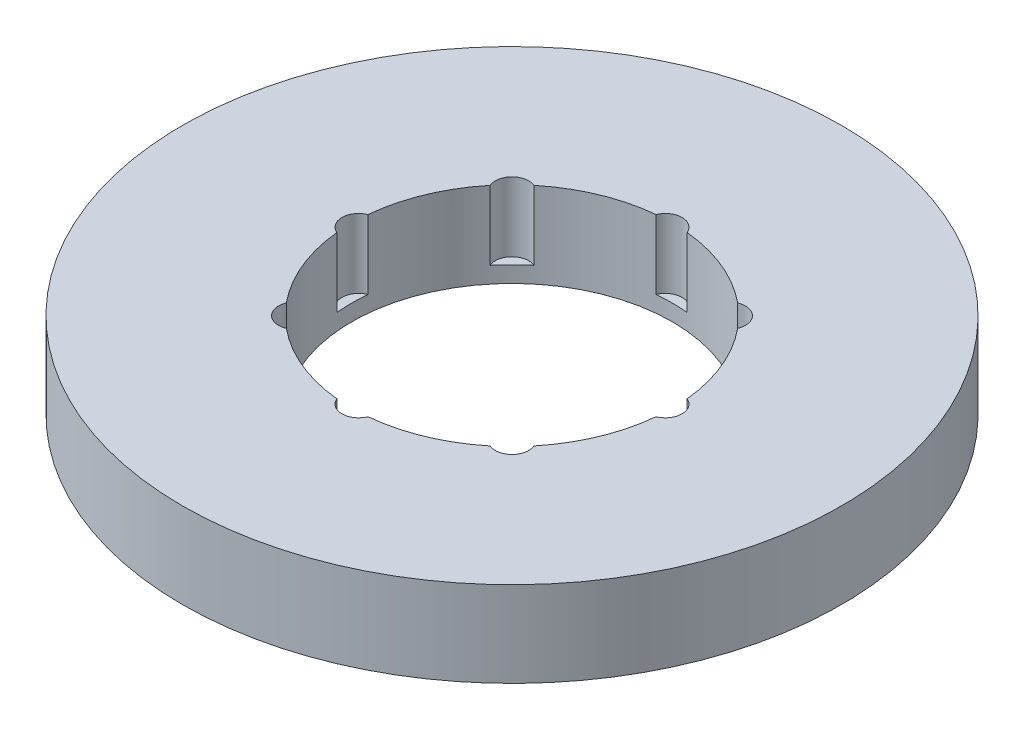
ISO-10303-21;
HEADER;
FILE_DESCRIPTION(('STEP AP214'),'2;1');
FILE_NAME('part.step','',(''),(''),'','','');
FILE_SCHEMA(('AUTOMOTIVE_DESIGN { 1 0 10303 214 1 1 1 1 }'));
ENDSEC;
DATA;
#1=APPLICATION_CONTEXT('core data for automotive mechanical design processes');
#2=APPLICATION_PROTOCOL_DEFINITION('international standard','automotive_design',2000,#1);
#3=PRODUCT_CONTEXT('',#1,'mechanical');
#4=PRODUCT('Part','Part','',(#3));
#5=PRODUCT_RELATED_PRODUCT_CATEGORY('part','',(#4));
#6=PRODUCT_DEFINITION_FORMATION('','',#4);
#7=PRODUCT_DEFINITION_CONTEXT('part definition',#1,'design');
#8=PRODUCT_DEFINITION('design','',#6,#7);
#9=PRODUCT_DEFINITION_SHAPE('','',#8);
#10=(LENGTH_UNIT() NAMED_UNIT(*) SI_UNIT(.MILLI.,.METRE.));
#11=(NAMED_UNIT(*) PLANE_ANGLE_UNIT() SI_UNIT($,.RADIAN.));
#12=(NAMED_UNIT(*) SI_UNIT($,.STERADIAN.) SOLID_ANGLE_UNIT());
#13=UNCERTAINTY_MEASURE_WITH_UNIT(LENGTH_MEASURE(1.E-05),#10,'distance_accuracy_value','');
#14=(GEOMETRIC_REPRESENTATION_CONTEXT(3) GLOBAL_UNCERTAINTY_ASSIGNED_CONTEXT((#13)) GLOBAL_UNIT_ASSIGNED_CONTEXT((#10,
#11,#12)) REPRESENTATION_CONTEXT('',''));
#15=CARTESIAN_POINT('',(0.,0.,0.));
#16=DIRECTION('',(0.,0.,1.));
#17=DIRECTION('',(1.,0.,0.));
#18=AXIS2_PLACEMENT_3D('',#15,#16,#17);
#19=CARTESIAN_POINT('',(0.,24.,0.));
#20=DIRECTION('',(0.,-1.,0.));
#21=DIRECTION('',(0.,0.,-1.));
#22=AXIS2_PLACEMENT_3D('',#19,#20,#21);
#23=CYLINDRICAL_SURFACE('',#22,92.5);
#24=CARTESIAN_POINT('',(0.,24.,0.));
#25=DIRECTION('',(0.,1.,0.));
#26=DIRECTION('',(0.,0.,1.));
#27=AXIS2_PLACEMENT_3D('',#24,#25,#26);
#28=CIRCLE('',#27,92.5);
#29=CARTESIAN_POINT('',(0.,24.,92.5));
#30=VERTEX_POINT('',#29);
#31=EDGE_CURVE('E183',#30,#30,#28,.T.);
#32=ORIENTED_EDGE('',*,*,#31,.F.);
#33=EDGE_LOOP('',(#32));
#34=FACE_BOUND('',#33,.T.);
#35=CARTESIAN_POINT('',(0.,0.,0.));
#36=DIRECTION('',(0.,1.,0.));
#37=DIRECTION('',(0.,0.,1.));
#38=AXIS2_PLACEMENT_3D('',#35,#36,#37);
#39=CIRCLE('',#38,92.5);
#40=CARTESIAN_POINT('',(0.,0.,92.5));
#41=VERTEX_POINT('',#40);
#42=EDGE_CURVE('E182',#41,#41,#39,.T.);
#43=ORIENTED_EDGE('',*,*,#42,.T.);
#44=EDGE_LOOP('',(#43));
#45=FACE_BOUND('',#44,.T.);
#46=ADVANCED_FACE('F39',(#34,#45),#23,.T.);
#47=CARTESIAN_POINT('',(0.,24.,0.));
#48=DIRECTION('',(0.,1.,0.));
#49=DIRECTION('',(0.,0.,1.));
#50=AXIS2_PLACEMENT_3D('',#47,#48,#49);
#51=PLANE('',#50);
#52=CARTESIAN_POINT('',(1.5021845709344E-13,24.,43.0242760922828));
#53=DIRECTION('',(0.,1.,0.));
#54=DIRECTION('',(1.,0.,0.));
#55=AXIS2_PLACEMENT_3D('',#52,#53,#54);
#56=CIRCLE('',#55,4.70772196916674);
#57=CARTESIAN_POINT('',(-4.36493019007772,24.,44.7878039697834));
#58=VERTEX_POINT('',#57);
#59=CARTESIAN_POINT('',(4.36493019007803,24.,44.7878039697834));
#60=VERTEX_POINT('',#59);
#61=EDGE_CURVE('E256',#58,#60,#56,.T.);
#62=ORIENTED_EDGE('',*,*,#61,.F.);
#63=CARTESIAN_POINT('',(0.,24.,0.));
#64=DIRECTION('',(0.,1.,0.));
#65=DIRECTION('',(0.,0.,1.));
#66=AXIS2_PLACEMENT_3D('',#63,#64,#65);
#67=CIRCLE('',#66,45.);
#68=CARTESIAN_POINT('',(-28.5832881646776,24.,34.7562316382976));
#69=VERTEX_POINT('',#68);
#70=EDGE_CURVE('E175',#69,#58,#67,.T.);
#71=ORIENTED_EDGE('',*,*,#70,.F.);
#72=CARTESIAN_POINT('',(-30.4227573804954,24.,30.4227573804955));
#73=DIRECTION('',(0.,1.,0.));
#74=DIRECTION('',(0.707106781186549,0.,0.707106781186546));
#75=AXIS2_PLACEMENT_3D('',#72,#73,#74);
#76=CIRCLE('',#75,4.70772196916674);
#77=CARTESIAN_POINT('',(-34.7562316382975,24.,28.5832881646777));
#78=VERTEX_POINT('',#77);
#79=EDGE_CURVE('E152',#78,#69,#76,.T.);
#80=ORIENTED_EDGE('',*,*,#79,.F.);
#81=CARTESIAN_POINT('',(-44.7878039697834,24.,4.36493019007788));
#82=VERTEX_POINT('',#81);
#83=EDGE_CURVE('E168',#82,#78,#67,.T.);
#84=ORIENTED_EDGE('',*,*,#83,.F.);
#85=CARTESIAN_POINT('',(-43.0242760922828,24.,0.));
#86=DIRECTION('',(0.,1.,0.));
#87=DIRECTION('',(0.,0.,1.));
#88=AXIS2_PLACEMENT_3D('',#85,#86,#87);
#89=CIRCLE('',#88,4.70772196916674);
#90=CARTESIAN_POINT('',(-44.7878039697834,24.,-4.36493019007788));
#91=VERTEX_POINT('',#90);
#92=EDGE_CURVE('E205',#91,#82,#89,.T.);
#93=ORIENTED_EDGE('',*,*,#92,.F.);
#94=CARTESIAN_POINT('',(-34.7562316382979,24.,-28.5832881646773));
#95=VERTEX_POINT('',#94);
#96=EDGE_CURVE('E181',#95,#91,#67,.T.);
#97=ORIENTED_EDGE('',*,*,#96,.F.);
#98=CARTESIAN_POINT('',(-30.4227573804958,24.,-30.422757380495));
#99=DIRECTION('',(0.,1.,0.));
#100=DIRECTION('',(-0.707106781186539,0.,0.707106781186556));
#101=AXIS2_PLACEMENT_3D('',#98,#99,#100);
#102=CIRCLE('',#101,4.70772196916674);
#103=CARTESIAN_POINT('',(-28.5832881646781,24.,-34.7562316382972));
#104=VERTEX_POINT('',#103);
#105=EDGE_CURVE('E453',#104,#95,#102,.T.);
#106=ORIENTED_EDGE('',*,*,#105,.F.);
#107=CARTESIAN_POINT('',(-4.36493019007835,24.,-44.7878039697834));
#108=VERTEX_POINT('',#107);
#109=EDGE_CURVE('E189',#108,#104,#67,.T.);
#110=ORIENTED_EDGE('',*,*,#109,.F.);
#111=CARTESIAN_POINT('',(-4.5065537128032E-13,24.,-43.0242760922828));
#112=DIRECTION('',(0.,1.,0.));
#113=DIRECTION('',(-1.,0.,0.));
#114=AXIS2_PLACEMENT_3D('',#111,#112,#113);
#115=CIRCLE('',#114,4.70772196916674);
#116=CARTESIAN_POINT('',(4.36493019007741,24.,-44.7878039697835));
#117=VERTEX_POINT('',#116);
#118=EDGE_CURVE('E462',#117,#108,#115,.T.);
#119=ORIENTED_EDGE('',*,*,#118,.F.);
#120=CARTESIAN_POINT('',(28.5832881646774,24.,-34.7562316382978));
#121=VERTEX_POINT('',#120);
#122=EDGE_CURVE('E197',#121,#117,#67,.T.);
#123=ORIENTED_EDGE('',*,*,#122,.F.);
#124=CARTESIAN_POINT('',(30.4227573804952,24.,-30.4227573804957));
#125=DIRECTION('',(0.,1.,0.));
#126=DIRECTION('',(-0.707106781186554,0.,-0.707106781186541));
#127=AXIS2_PLACEMENT_3D('',#124,#125,#126);
#128=CIRCLE('',#127,4.70772196916674);
#129=CARTESIAN_POINT('',(34.7562316382973,24.,-28.583288164678));
#130=VERTEX_POINT('',#129);
#131=EDGE_CURVE('E470',#130,#121,#128,.T.);
#132=ORIENTED_EDGE('',*,*,#131,.F.);
#133=CARTESIAN_POINT('',(44.7878039697834,24.,-4.36493019007788));
#134=VERTEX_POINT('',#133);
#135=EDGE_CURVE('E489',#134,#130,#67,.T.);
#136=ORIENTED_EDGE('',*,*,#135,.F.);
#137=CARTESIAN_POINT('',(43.0242760922828,24.,0.));
#138=DIRECTION('',(0.,1.,0.));
#139=DIRECTION('',(0.,0.,-1.));
#140=AXIS2_PLACEMENT_3D('',#137,#138,#139);
#141=CIRCLE('',#140,4.70772196916674);
#142=CARTESIAN_POINT('',(44.7878039697834,24.,4.36493019007788));
#143=VERTEX_POINT('',#142);
#144=EDGE_CURVE('E476',#143,#134,#141,.T.);
#145=ORIENTED_EDGE('',*,*,#144,.F.);
#146=CARTESIAN_POINT('',(34.7562316382977,24.,28.5832881646775));
#147=VERTEX_POINT('',#146);
#148=EDGE_CURVE('E491',#147,#143,#67,.T.);
#149=ORIENTED_EDGE('',*,*,#148,.F.);
#150=CARTESIAN_POINT('',(30.4227573804956,24.,30.4227573804953));
#151=DIRECTION('',(0.,1.,0.));
#152=DIRECTION('',(0.707106781186544,0.,-0.707106781186551));
#153=AXIS2_PLACEMENT_3D('',#150,#151,#152);
#154=CIRCLE('',#153,4.70772196916674);
#155=CARTESIAN_POINT('',(28.5832881646779,24.,34.7562316382974));
#156=VERTEX_POINT('',#155);
#157=EDGE_CURVE('E475',#156,#147,#154,.T.);
#158=ORIENTED_EDGE('',*,*,#157,.F.);
#159=EDGE_CURVE('E190',#60,#156,#67,.T.);
#160=ORIENTED_EDGE('',*,*,#159,.F.);
#161=EDGE_LOOP('',(#62,#71,#80,#84,#93,#97,#106,#110,#119,#123,#132,#136,#145,#149,#158,#160));
#162=FACE_BOUND('',#161,.T.);
#163=ORIENTED_EDGE('',*,*,#31,.T.);
#164=EDGE_LOOP('',(#163));
#165=FACE_BOUND('',#164,.T.);
#166=ADVANCED_FACE('F170',(#162,#165),#51,.T.);
#167=CARTESIAN_POINT('',(0.,0.,0.));
#168=DIRECTION('',(0.,1.,0.));
#169=DIRECTION('',(0.,0.,1.));
#170=AXIS2_PLACEMENT_3D('',#167,#168,#169);
#171=PLANE('',#170);
#172=CARTESIAN_POINT('',(0.,0.,0.));
#173=DIRECTION('',(0.,1.,0.));
#174=DIRECTION('',(0.,0.,1.));
#175=AXIS2_PLACEMENT_3D('',#172,#173,#174);
#176=CIRCLE('',#175,45.);
#177=CARTESIAN_POINT('',(0.,0.,45.));
#178=VERTEX_POINT('',#177);
#179=EDGE_CURVE('E191',#178,#178,#176,.T.);
#180=ORIENTED_EDGE('',*,*,#179,.T.);
#181=EDGE_LOOP('',(#180));
#182=FACE_BOUND('',#181,.T.);
#183=ORIENTED_EDGE('',*,*,#42,.F.);
#184=EDGE_LOOP('',(#183));
#185=FACE_BOUND('',#184,.T.);
#186=ADVANCED_FACE('F277',(#182,#185),#171,.F.);
#187=CARTESIAN_POINT('',(0.,24.,0.));
#188=DIRECTION('',(0.,-1.,0.));
#189=DIRECTION('',(0.,0.,-1.));
#190=AXIS2_PLACEMENT_3D('',#187,#188,#189);
#191=CYLINDRICAL_SURFACE('',#190,45.);
#192=DIRECTION('',(0.,1.,0.));
#193=VECTOR('',#192,1.);
#194=CARTESIAN_POINT('',(-4.36493019007772,14.2812641336552,44.7878039697835));
#195=LINE('',#194,#193);
#196=CARTESIAN_POINT('',(-4.36493019007772,4.56252826731032,44.7878039697834));
#197=VERTEX_POINT('',#196);
#198=EDGE_CURVE('E11',#197,#58,#195,.T.);
#199=ORIENTED_EDGE('',*,*,#198,.F.);
#200=CARTESIAN_POINT('',(0.,4.56252826731032,0.));
#201=DIRECTION('',(0.,1.,0.));
#202=DIRECTION('',(0.,0.,1.));
#203=AXIS2_PLACEMENT_3D('',#200,#201,#202);
#204=CIRCLE('',#203,45.);
#205=CARTESIAN_POINT('',(4.36493019007803,4.56252826731032,44.7878039697834));
#206=VERTEX_POINT('',#205);
#207=EDGE_CURVE('E251',#197,#206,#204,.T.);
#208=ORIENTED_EDGE('',*,*,#207,.T.);
#209=DIRECTION('',(0.,1.,0.));
#210=VECTOR('',#209,1.);
#211=CARTESIAN_POINT('',(4.36493019007802,14.2812641336552,44.7878039697834));
#212=LINE('',#211,#210);
#213=EDGE_CURVE('E46',#60,#206,#212,.F.);
#214=ORIENTED_EDGE('',*,*,#213,.F.);
#215=ORIENTED_EDGE('',*,*,#159,.T.);
#216=DIRECTION('',(0.,1.,0.));
#217=VECTOR('',#216,1.);
#218=CARTESIAN_POINT('',(28.5832881646779,14.2812641336552,34.7562316382974));
#219=LINE('',#218,#217);
#220=CARTESIAN_POINT('',(28.5832881646779,4.56252826731032,34.7562316382974));
#221=VERTEX_POINT('',#220);
#222=EDGE_CURVE('E253',#221,#156,#219,.T.);
#223=ORIENTED_EDGE('',*,*,#222,.F.);
#224=CARTESIAN_POINT('',(0.,4.56252826731032,0.));
#225=DIRECTION('',(0.,1.,0.));
#226=DIRECTION('',(0.,0.,1.));
#227=AXIS2_PLACEMENT_3D('',#224,#225,#226);
#228=CIRCLE('',#227,45.);
#229=CARTESIAN_POINT('',(34.7562316382977,4.56252826731032,28.5832881646775));
#230=VERTEX_POINT('',#229);
#231=EDGE_CURVE('E246',#221,#230,#228,.T.);
#232=ORIENTED_EDGE('',*,*,#231,.T.);
#233=DIRECTION('',(0.,1.,0.));
#234=VECTOR('',#233,1.);
#235=CARTESIAN_POINT('',(34.7562316382977,14.2812641336552,28.5832881646775));
#236=LINE('',#235,#234);
#237=EDGE_CURVE('E248',#147,#230,#236,.F.);
#238=ORIENTED_EDGE('',*,*,#237,.F.);
#239=ORIENTED_EDGE('',*,*,#148,.T.);
#240=DIRECTION('',(0.,1.,0.));
#241=VECTOR('',#240,1.);
#242=CARTESIAN_POINT('',(44.7878039697834,14.2812641336552,4.36493019007787));
#243=LINE('',#242,#241);
#244=CARTESIAN_POINT('',(44.7878039697834,4.56252826731032,4.36493019007788));
#245=VERTEX_POINT('',#244);
#246=EDGE_CURVE('E243',#245,#143,#243,.T.);
#247=ORIENTED_EDGE('',*,*,#246,.F.);
#248=CARTESIAN_POINT('',(0.,4.56252826731032,0.));
#249=DIRECTION('',(0.,1.,0.));
#250=DIRECTION('',(0.,0.,1.));
#251=AXIS2_PLACEMENT_3D('',#248,#249,#250);
#252=CIRCLE('',#251,45.);
#253=CARTESIAN_POINT('',(44.7878039697834,4.56252826731032,-4.36493019007788));
#254=VERTEX_POINT('',#253);
#255=EDGE_CURVE('E236',#245,#254,#252,.T.);
#256=ORIENTED_EDGE('',*,*,#255,.T.);
#257=DIRECTION('',(0.,1.,0.));
#258=VECTOR('',#257,1.);
#259=CARTESIAN_POINT('',(44.7878039697834,14.2812641336552,-4.36493019007787));
#260=LINE('',#259,#258);
#261=EDGE_CURVE('E241',#134,#254,#260,.F.);
#262=ORIENTED_EDGE('',*,*,#261,.F.);
#263=ORIENTED_EDGE('',*,*,#135,.T.);
#264=DIRECTION('',(0.,1.,0.));
#265=VECTOR('',#264,1.);
#266=CARTESIAN_POINT('',(34.7562316382973,14.2812641336552,-28.583288164678));
#267=LINE('',#266,#265);
#268=CARTESIAN_POINT('',(34.7562316382973,4.56252826731032,-28.583288164678));
#269=VERTEX_POINT('',#268);
#270=EDGE_CURVE('E237',#269,#130,#267,.T.);
#271=ORIENTED_EDGE('',*,*,#270,.F.);
#272=CARTESIAN_POINT('',(0.,4.56252826731032,0.));
#273=DIRECTION('',(0.,1.,0.));
#274=DIRECTION('',(0.,0.,1.));
#275=AXIS2_PLACEMENT_3D('',#272,#273,#274);
#276=CIRCLE('',#275,45.);
#277=CARTESIAN_POINT('',(28.5832881646774,4.56252826731032,-34.7562316382978));
#278=VERTEX_POINT('',#277);
#279=EDGE_CURVE('E229',#269,#278,#276,.T.);
#280=ORIENTED_EDGE('',*,*,#279,.T.);
#281=DIRECTION('',(0.,1.,0.));
#282=VECTOR('',#281,1.);
#283=CARTESIAN_POINT('',(28.5832881646774,14.2812641336552,-34.7562316382978));
#284=LINE('',#283,#282);
#285=EDGE_CURVE('E232',#121,#278,#284,.F.);
#286=ORIENTED_EDGE('',*,*,#285,.F.);
#287=ORIENTED_EDGE('',*,*,#122,.T.);
#288=DIRECTION('',(0.,1.,0.));
#289=VECTOR('',#288,1.);
#290=CARTESIAN_POINT('',(4.3649301900774,14.2812641336552,-44.7878039697835));
#291=LINE('',#290,#289);
#292=CARTESIAN_POINT('',(4.36493019007741,4.56252826731032,-44.7878039697835));
#293=VERTEX_POINT('',#292);
#294=EDGE_CURVE('E227',#293,#117,#291,.T.);
#295=ORIENTED_EDGE('',*,*,#294,.F.);
#296=CARTESIAN_POINT('',(0.,4.56252826731032,0.));
#297=DIRECTION('',(0.,1.,0.));
#298=DIRECTION('',(0.,0.,1.));
#299=AXIS2_PLACEMENT_3D('',#296,#297,#298);
#300=CIRCLE('',#299,45.);
#301=CARTESIAN_POINT('',(-4.36493019007835,4.56252826731032,-44.7878039697834));
#302=VERTEX_POINT('',#301);
#303=EDGE_CURVE('E225',#293,#302,#300,.T.);
#304=ORIENTED_EDGE('',*,*,#303,.T.);
#305=DIRECTION('',(0.,1.,0.));
#306=VECTOR('',#305,1.);
#307=CARTESIAN_POINT('',(-4.36493019007834,14.2812641336552,-44.7878039697834));
#308=LINE('',#307,#306);
#309=EDGE_CURVE('E223',#108,#302,#308,.F.);
#310=ORIENTED_EDGE('',*,*,#309,.F.);
#311=ORIENTED_EDGE('',*,*,#109,.T.);
#312=DIRECTION('',(0.,1.,0.));
#313=VECTOR('',#312,1.);
#314=CARTESIAN_POINT('',(-28.5832881646781,14.2812641336552,-34.7562316382972));
#315=LINE('',#314,#313);
#316=CARTESIAN_POINT('',(-28.5832881646781,4.56252826731032,-34.7562316382972));
#317=VERTEX_POINT('',#316);
#318=EDGE_CURVE('E219',#317,#104,#315,.T.);
#319=ORIENTED_EDGE('',*,*,#318,.F.);
#320=CARTESIAN_POINT('',(0.,4.56252826731032,0.));
#321=DIRECTION('',(0.,1.,0.));
#322=DIRECTION('',(0.,0.,1.));
#323=AXIS2_PLACEMENT_3D('',#320,#321,#322);
#324=CIRCLE('',#323,45.);
#325=CARTESIAN_POINT('',(-34.7562316382979,4.56252826731032,-28.5832881646773));
#326=VERTEX_POINT('',#325);
#327=EDGE_CURVE('E159',#317,#326,#324,.T.);
#328=ORIENTED_EDGE('',*,*,#327,.T.);
#329=DIRECTION('',(0.,1.,0.));
#330=VECTOR('',#329,1.);
#331=CARTESIAN_POINT('',(-34.7562316382979,14.2812641336552,-28.5832881646773));
#332=LINE('',#331,#330);
#333=EDGE_CURVE('E220',#95,#326,#332,.F.);
#334=ORIENTED_EDGE('',*,*,#333,.F.);
#335=ORIENTED_EDGE('',*,*,#96,.T.);
#336=DIRECTION('',(0.,1.,0.));
#337=VECTOR('',#336,1.);
#338=CARTESIAN_POINT('',(-44.7878039697834,14.2812641336552,-4.36493019007787));
#339=LINE('',#338,#337);
#340=CARTESIAN_POINT('',(-44.7878039697834,4.56252826731032,-4.36493019007788));
#341=VERTEX_POINT('',#340);
#342=EDGE_CURVE('E209',#341,#91,#339,.T.);
#343=ORIENTED_EDGE('',*,*,#342,.F.);
#344=CARTESIAN_POINT('',(0.,4.56252826731032,0.));
#345=DIRECTION('',(0.,1.,0.));
#346=DIRECTION('',(0.,0.,1.));
#347=AXIS2_PLACEMENT_3D('',#344,#345,#346);
#348=CIRCLE('',#347,45.);
#349=CARTESIAN_POINT('',(-44.7878039697834,4.56252826731032,4.36493019007788));
#350=VERTEX_POINT('',#349);
#351=EDGE_CURVE('E206',#341,#350,#348,.T.);
#352=ORIENTED_EDGE('',*,*,#351,.T.);
#353=DIRECTION('',(0.,1.,0.));
#354=VECTOR('',#353,1.);
#355=CARTESIAN_POINT('',(-44.7878039697834,14.2812641336552,4.36493019007787));
#356=LINE('',#355,#354);
#357=EDGE_CURVE('E179',#82,#350,#356,.F.);
#358=ORIENTED_EDGE('',*,*,#357,.F.);
#359=ORIENTED_EDGE('',*,*,#83,.T.);
#360=DIRECTION('',(0.,1.,0.));
#361=VECTOR('',#360,1.);
#362=CARTESIAN_POINT('',(-34.7562316382975,14.2812641336552,28.5832881646778));
#363=LINE('',#362,#361);
#364=CARTESIAN_POINT('',(-34.7562316382975,4.56252826731032,28.5832881646777));
#365=VERTEX_POINT('',#364);
#366=EDGE_CURVE('E147',#365,#78,#363,.T.);
#367=ORIENTED_EDGE('',*,*,#366,.F.);
#368=CARTESIAN_POINT('',(0.,4.56252826731032,0.));
#369=DIRECTION('',(0.,1.,0.));
#370=DIRECTION('',(0.,0.,1.));
#371=AXIS2_PLACEMENT_3D('',#368,#369,#370);
#372=CIRCLE('',#371,45.);
#373=CARTESIAN_POINT('',(-28.5832881646776,4.56252826731032,34.7562316382976));
#374=VERTEX_POINT('',#373);
#375=EDGE_CURVE('E215',#365,#374,#372,.T.);
#376=ORIENTED_EDGE('',*,*,#375,.T.);
#377=DIRECTION('',(0.,1.,0.));
#378=VECTOR('',#377,1.);
#379=CARTESIAN_POINT('',(-28.5832881646776,14.2812641336552,34.7562316382976));
#380=LINE('',#379,#378);
#381=EDGE_CURVE('E161',#69,#374,#380,.F.);
#382=ORIENTED_EDGE('',*,*,#381,.F.);
#383=ORIENTED_EDGE('',*,*,#70,.T.);
#384=EDGE_LOOP('',(#199,#208,#214,#215,#223,#232,#238,#239,#247,#256,#262,#263,#271,#280,#286,
#287,#295,#304,#310,#311,#319,#328,#334,#335,#343,#352,#358,#359,#367,#376,#382,#383));
#385=FACE_BOUND('',#384,.T.);
#386=ORIENTED_EDGE('',*,*,#179,.F.);
#387=EDGE_LOOP('',(#386));
#388=FACE_BOUND('',#387,.T.);
#389=ADVANCED_FACE('F176',(#385,#388),#191,.F.);
#390=CARTESIAN_POINT('',(-43.0242760922828,4.56252826731032,0.));
#391=DIRECTION('',(0.,1.,0.));
#392=DIRECTION('',(0.,0.,1.));
#393=AXIS2_PLACEMENT_3D('',#390,#391,#392);
#394=CYLINDRICAL_SURFACE('',#393,4.70772196916674);
#395=ORIENTED_EDGE('',*,*,#342,.T.);
#396=ORIENTED_EDGE('',*,*,#92,.T.);
#397=ORIENTED_EDGE('',*,*,#357,.T.);
#398=CARTESIAN_POINT('',(-43.0242760922828,4.56252826731032,0.));
#399=DIRECTION('',(0.,1.,0.));
#400=DIRECTION('',(0.,0.,1.));
#401=AXIS2_PLACEMENT_3D('',#398,#399,#400);
#402=CIRCLE('',#401,4.70772196916674);
#403=EDGE_CURVE('E200',#341,#350,#402,.T.);
#404=ORIENTED_EDGE('',*,*,#403,.F.);
#405=EDGE_LOOP('',(#395,#396,#397,#404));
#406=FACE_BOUND('',#405,.T.);
#407=ADVANCED_FACE('F286',(#406),#394,.F.);
#408=CARTESIAN_POINT('',(-43.0242760922828,4.56252826731032,0.));
#409=DIRECTION('',(0.,1.,0.));
#410=DIRECTION('',(0.,0.,1.));
#411=AXIS2_PLACEMENT_3D('',#408,#409,#410);
#412=PLANE('',#411);
#413=ORIENTED_EDGE('',*,*,#403,.T.);
#414=ORIENTED_EDGE('',*,*,#351,.F.);
#415=EDGE_LOOP('',(#413,#414));
#416=FACE_BOUND('',#415,.T.);
#417=ADVANCED_FACE('F289',(#416),#412,.T.);
#418=CARTESIAN_POINT('',(-30.4227573804954,4.56252826731032,30.4227573804955));
#419=DIRECTION('',(0.,1.,0.));
#420=DIRECTION('',(0.,0.,1.));
#421=AXIS2_PLACEMENT_3D('',#418,#419,#420);
#422=CYLINDRICAL_SURFACE('',#421,4.70772196916674);
#423=ORIENTED_EDGE('',*,*,#366,.T.);
#424=ORIENTED_EDGE('',*,*,#79,.T.);
#425=ORIENTED_EDGE('',*,*,#381,.T.);
#426=CARTESIAN_POINT('',(-30.4227573804954,4.56252826731032,30.4227573804955));
#427=DIRECTION('',(0.,1.,0.));
#428=DIRECTION('',(0.707106781186549,0.,0.707106781186546));
#429=AXIS2_PLACEMENT_3D('',#426,#427,#428);
#430=CIRCLE('',#429,4.70772196916674);
#431=EDGE_CURVE('E156',#365,#374,#430,.T.);
#432=ORIENTED_EDGE('',*,*,#431,.F.);
#433=EDGE_LOOP('',(#423,#424,#425,#432));
#434=FACE_BOUND('',#433,.T.);
#435=ADVANCED_FACE('F155',(#434),#422,.F.);
#436=CARTESIAN_POINT('',(-30.4227573804954,4.56252826731032,30.4227573804955));
#437=DIRECTION('',(0.,1.,0.));
#438=DIRECTION('',(0.707106781186549,0.,0.707106781186546));
#439=AXIS2_PLACEMENT_3D('',#436,#437,#438);
#440=PLANE('',#439);
#441=ORIENTED_EDGE('',*,*,#431,.T.);
#442=ORIENTED_EDGE('',*,*,#375,.F.);
#443=EDGE_LOOP('',(#441,#442));
#444=FACE_BOUND('',#443,.T.);
#445=ADVANCED_FACE('F300',(#444),#440,.T.);
#446=CARTESIAN_POINT('',(-30.4227573804958,4.56252826731032,-30.422757380495));
#447=DIRECTION('',(0.,1.,0.));
#448=DIRECTION('',(0.,0.,1.));
#449=AXIS2_PLACEMENT_3D('',#446,#447,#448);
#450=CYLINDRICAL_SURFACE('',#449,4.70772196916674);
#451=ORIENTED_EDGE('',*,*,#318,.T.);
#452=ORIENTED_EDGE('',*,*,#105,.T.);
#453=ORIENTED_EDGE('',*,*,#333,.T.);
#454=CARTESIAN_POINT('',(-30.4227573804958,4.56252826731032,-30.422757380495));
#455=DIRECTION('',(0.,1.,0.));
#456=DIRECTION('',(-0.707106781186539,0.,0.707106781186556));
#457=AXIS2_PLACEMENT_3D('',#454,#455,#456);
#458=CIRCLE('',#457,4.70772196916674);
#459=EDGE_CURVE('E454',#317,#326,#458,.T.);
#460=ORIENTED_EDGE('',*,*,#459,.F.);
#461=EDGE_LOOP('',(#451,#452,#453,#460));
#462=FACE_BOUND('',#461,.T.);
#463=ADVANCED_FACE('F299',(#462),#450,.F.);
#464=CARTESIAN_POINT('',(-30.4227573804958,4.56252826731032,-30.422757380495));
#465=DIRECTION('',(0.,1.,0.));
#466=DIRECTION('',(-0.707106781186539,0.,0.707106781186556));
#467=AXIS2_PLACEMENT_3D('',#464,#465,#466);
#468=PLANE('',#467);
#469=ORIENTED_EDGE('',*,*,#459,.T.);
#470=ORIENTED_EDGE('',*,*,#327,.F.);
#471=EDGE_LOOP('',(#469,#470));
#472=FACE_BOUND('',#471,.T.);
#473=ADVANCED_FACE('F379',(#472),#468,.T.);
#474=CARTESIAN_POINT('',(-4.5065537128032E-13,4.56252826731032,-43.0242760922828));
#475=DIRECTION('',(0.,1.,0.));
#476=DIRECTION('',(0.,0.,1.));
#477=AXIS2_PLACEMENT_3D('',#474,#475,#476);
#478=CYLINDRICAL_SURFACE('',#477,4.70772196916674);
#479=ORIENTED_EDGE('',*,*,#294,.T.);
#480=ORIENTED_EDGE('',*,*,#118,.T.);
#481=ORIENTED_EDGE('',*,*,#309,.T.);
#482=CARTESIAN_POINT('',(-4.5065537128032E-13,4.56252826731032,-43.0242760922828));
#483=DIRECTION('',(0.,1.,0.));
#484=DIRECTION('',(-1.,0.,0.));
#485=AXIS2_PLACEMENT_3D('',#482,#483,#484);
#486=CIRCLE('',#485,4.70772196916674);
#487=EDGE_CURVE('E465',#293,#302,#486,.T.);
#488=ORIENTED_EDGE('',*,*,#487,.F.);
#489=EDGE_LOOP('',(#479,#480,#481,#488));
#490=FACE_BOUND('',#489,.T.);
#491=ADVANCED_FACE('F371',(#490),#478,.F.);
#492=CARTESIAN_POINT('',(-4.5065537128032E-13,4.56252826731032,-43.0242760922828));
#493=DIRECTION('',(0.,1.,0.));
#494=DIRECTION('',(-1.,0.,0.));
#495=AXIS2_PLACEMENT_3D('',#492,#493,#494);
#496=PLANE('',#495);
#497=ORIENTED_EDGE('',*,*,#487,.T.);
#498=ORIENTED_EDGE('',*,*,#303,.F.);
#499=EDGE_LOOP('',(#497,#498));
#500=FACE_BOUND('',#499,.T.);
#501=ADVANCED_FACE('F308',(#500),#496,.T.);
#502=CARTESIAN_POINT('',(30.4227573804952,4.56252826731032,-30.4227573804957));
#503=DIRECTION('',(0.,1.,0.));
#504=DIRECTION('',(0.,0.,1.));
#505=AXIS2_PLACEMENT_3D('',#502,#503,#504);
#506=CYLINDRICAL_SURFACE('',#505,4.70772196916674);
#507=ORIENTED_EDGE('',*,*,#270,.T.);
#508=ORIENTED_EDGE('',*,*,#131,.T.);
#509=ORIENTED_EDGE('',*,*,#285,.T.);
#510=CARTESIAN_POINT('',(30.4227573804952,4.56252826731032,-30.4227573804957));
#511=DIRECTION('',(0.,1.,0.));
#512=DIRECTION('',(-0.707106781186554,0.,-0.707106781186541));
#513=AXIS2_PLACEMENT_3D('',#510,#511,#512);
#514=CIRCLE('',#513,4.70772196916674);
#515=EDGE_CURVE('E477',#269,#278,#514,.T.);
#516=ORIENTED_EDGE('',*,*,#515,.F.);
#517=EDGE_LOOP('',(#507,#508,#509,#516));
#518=FACE_BOUND('',#517,.T.);
#519=ADVANCED_FACE('F305',(#518),#506,.F.);
#520=CARTESIAN_POINT('',(30.4227573804952,4.56252826731032,-30.4227573804957));
#521=DIRECTION('',(0.,1.,0.));
#522=DIRECTION('',(-0.707106781186554,0.,-0.707106781186541));
#523=AXIS2_PLACEMENT_3D('',#520,#521,#522);
#524=PLANE('',#523);
#525=ORIENTED_EDGE('',*,*,#515,.T.);
#526=ORIENTED_EDGE('',*,*,#279,.F.);
#527=EDGE_LOOP('',(#525,#526));
#528=FACE_BOUND('',#527,.T.);
#529=ADVANCED_FACE('F304',(#528),#524,.T.);
#530=CARTESIAN_POINT('',(43.0242760922828,4.56252826731032,0.));
#531=DIRECTION('',(0.,1.,0.));
#532=DIRECTION('',(0.,0.,1.));
#533=AXIS2_PLACEMENT_3D('',#530,#531,#532);
#534=CYLINDRICAL_SURFACE('',#533,4.70772196916674);
#535=ORIENTED_EDGE('',*,*,#246,.T.);
#536=ORIENTED_EDGE('',*,*,#144,.T.);
#537=ORIENTED_EDGE('',*,*,#261,.T.);
#538=CARTESIAN_POINT('',(43.0242760922828,4.56252826731032,0.));
#539=DIRECTION('',(0.,1.,0.));
#540=DIRECTION('',(0.,0.,-1.));
#541=AXIS2_PLACEMENT_3D('',#538,#539,#540);
#542=CIRCLE('',#541,4.70772196916674);
#543=EDGE_CURVE('E478',#245,#254,#542,.T.);
#544=ORIENTED_EDGE('',*,*,#543,.F.);
#545=EDGE_LOOP('',(#535,#536,#537,#544));
#546=FACE_BOUND('',#545,.T.);
#547=ADVANCED_FACE('F309',(#546),#534,.F.);
#548=CARTESIAN_POINT('',(43.0242760922828,4.56252826731032,0.));
#549=DIRECTION('',(0.,1.,0.));
#550=DIRECTION('',(0.,0.,-1.));
#551=AXIS2_PLACEMENT_3D('',#548,#549,#550);
#552=PLANE('',#551);
#553=ORIENTED_EDGE('',*,*,#543,.T.);
#554=ORIENTED_EDGE('',*,*,#255,.F.);
#555=EDGE_LOOP('',(#553,#554));
#556=FACE_BOUND('',#555,.T.);
#557=ADVANCED_FACE('F314',(#556),#552,.T.);
#558=CARTESIAN_POINT('',(30.4227573804956,4.56252826731032,30.4227573804953));
#559=DIRECTION('',(0.,1.,0.));
#560=DIRECTION('',(0.,0.,1.));
#561=AXIS2_PLACEMENT_3D('',#558,#559,#560);
#562=CYLINDRICAL_SURFACE('',#561,4.70772196916674);
#563=ORIENTED_EDGE('',*,*,#222,.T.);
#564=ORIENTED_EDGE('',*,*,#157,.T.);
#565=ORIENTED_EDGE('',*,*,#237,.T.);
#566=CARTESIAN_POINT('',(30.4227573804956,4.56252826731032,30.4227573804953));
#567=DIRECTION('',(0.,1.,0.));
#568=DIRECTION('',(0.707106781186544,0.,-0.707106781186551));
#569=AXIS2_PLACEMENT_3D('',#566,#567,#568);
#570=CIRCLE('',#569,4.70772196916674);
#571=EDGE_CURVE('E56',#221,#230,#570,.T.);
#572=ORIENTED_EDGE('',*,*,#571,.F.);
#573=EDGE_LOOP('',(#563,#564,#565,#572));
#574=FACE_BOUND('',#573,.T.);
#575=ADVANCED_FACE('F318',(#574),#562,.F.);
#576=CARTESIAN_POINT('',(30.4227573804956,4.56252826731032,30.4227573804953));
#577=DIRECTION('',(0.,1.,0.));
#578=DIRECTION('',(0.707106781186544,0.,-0.707106781186551));
#579=AXIS2_PLACEMENT_3D('',#576,#577,#578);
#580=PLANE('',#579);
#581=ORIENTED_EDGE('',*,*,#571,.T.);
#582=ORIENTED_EDGE('',*,*,#231,.F.);
#583=EDGE_LOOP('',(#581,#582));
#584=FACE_BOUND('',#583,.T.);
#585=ADVANCED_FACE('F270',(#584),#580,.T.);
#586=CARTESIAN_POINT('',(1.5021845709344E-13,4.56252826731032,43.0242760922828));
#587=DIRECTION('',(0.,1.,0.));
#588=DIRECTION('',(0.,0.,1.));
#589=AXIS2_PLACEMENT_3D('',#586,#587,#588);
#590=CYLINDRICAL_SURFACE('',#589,4.70772196916674);
#591=ORIENTED_EDGE('',*,*,#198,.T.);
#592=ORIENTED_EDGE('',*,*,#61,.T.);
#593=ORIENTED_EDGE('',*,*,#213,.T.);
#594=CARTESIAN_POINT('',(1.5021845709344E-13,4.56252826731032,43.0242760922828));
#595=DIRECTION('',(0.,1.,0.));
#596=DIRECTION('',(1.,0.,0.));
#597=AXIS2_PLACEMENT_3D('',#594,#595,#596);
#598=CIRCLE('',#597,4.70772196916674);
#599=EDGE_CURVE('E55',#197,#206,#598,.T.);
#600=ORIENTED_EDGE('',*,*,#599,.F.);
#601=EDGE_LOOP('',(#591,#592,#593,#600));
#602=FACE_BOUND('',#601,.T.);
#603=ADVANCED_FACE('F260',(#602),#590,.F.);
#604=CARTESIAN_POINT('',(1.5021845709344E-13,4.56252826731032,43.0242760922828));
#605=DIRECTION('',(0.,1.,0.));
#606=DIRECTION('',(1.,0.,0.));
#607=AXIS2_PLACEMENT_3D('',#604,#605,#606);
#608=PLANE('',#607);
#609=ORIENTED_EDGE('',*,*,#599,.T.);
#610=ORIENTED_EDGE('',*,*,#207,.F.);
#611=EDGE_LOOP('',(#609,#610));
#612=FACE_BOUND('',#611,.T.);
#613=ADVANCED_FACE('F261',(#612),#608,.T.);
#614=CLOSED_SHELL('',(#46,#166,#186,#389,#407,#417,#435,#445,#463,#473,#491,#501,#519,#529,#547,
#557,#575,#585,#603,#613));
#615=MANIFOLD_SOLID_BREP('B2',#614);
#616=ADVANCED_BREP_SHAPE_REPRESENTATION('',(#18,#615),#14);
#617=SHAPE_DEFINITION_REPRESENTATION(#9,#616);
ENDSEC;
END-ISO-10303-21;
